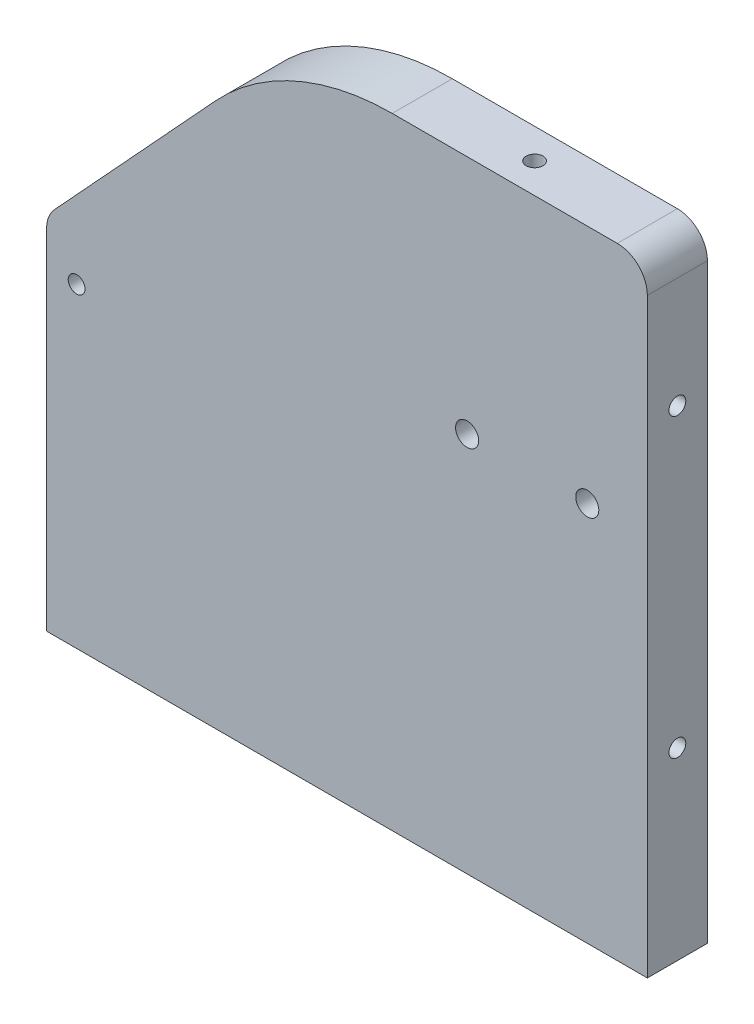
ISO-10303-21;
HEADER;
FILE_DESCRIPTION(('STEP AP214'),'2;1');
FILE_NAME('part.step','',(''),(''),'','','');
FILE_SCHEMA(('AUTOMOTIVE_DESIGN { 1 0 10303 214 1 1 1 1 }'));
ENDSEC;
DATA;
#1=APPLICATION_CONTEXT('core data for automotive mechanical design processes');
#2=APPLICATION_PROTOCOL_DEFINITION('international standard','automotive_design',2000,#1);
#3=PRODUCT_CONTEXT('',#1,'mechanical');
#4=PRODUCT('Part','Part','',(#3));
#5=PRODUCT_RELATED_PRODUCT_CATEGORY('part','',(#4));
#6=PRODUCT_DEFINITION_FORMATION('','',#4);
#7=PRODUCT_DEFINITION_CONTEXT('part definition',#1,'design');
#8=PRODUCT_DEFINITION('design','',#6,#7);
#9=PRODUCT_DEFINITION_SHAPE('','',#8);
#10=(LENGTH_UNIT() NAMED_UNIT(*) SI_UNIT(.MILLI.,.METRE.));
#11=(NAMED_UNIT(*) PLANE_ANGLE_UNIT() SI_UNIT($,.RADIAN.));
#12=(NAMED_UNIT(*) SI_UNIT($,.STERADIAN.) SOLID_ANGLE_UNIT());
#13=UNCERTAINTY_MEASURE_WITH_UNIT(LENGTH_MEASURE(1.E-05),#10,'distance_accuracy_value','');
#14=(GEOMETRIC_REPRESENTATION_CONTEXT(3) GLOBAL_UNCERTAINTY_ASSIGNED_CONTEXT((#13)) GLOBAL_UNIT_ASSIGNED_CONTEXT((#10,
#11,#12)) REPRESENTATION_CONTEXT('',''));
#15=CARTESIAN_POINT('',(0.,0.,0.));
#16=DIRECTION('',(0.,0.,1.));
#17=DIRECTION('',(1.,0.,0.));
#18=AXIS2_PLACEMENT_3D('',#15,#16,#17);
#19=CARTESIAN_POINT('',(25.4,65.659,3.175));
#20=DIRECTION('',(0.735322884140095,-0.677716943907921,0.));
#21=DIRECTION('',(0.677716943907921,0.735322884140095,0.));
#22=AXIS2_PLACEMENT_3D('',#19,#20,#21);
#23=PLANE('',#22);
#24=CARTESIAN_POINT('',(9.36128497860955,48.2569942017914,0.));
#25=DIRECTION('',(-0.735322884140095,0.677716943907922,0.));
#26=DIRECTION('',(-0.677716943907922,-0.735322884140095,0.));
#27=AXIS2_PLACEMENT_3D('',#24,#25,#26);
#28=CIRCLE('',#27,0.888999999999989);
#29=CARTESIAN_POINT('',(8.75879461547542,47.6032921577908,0.));
#30=VERTEX_POINT('',#29);
#31=EDGE_CURVE('E167',#30,#30,#28,.T.);
#32=ORIENTED_EDGE('',*,*,#31,.F.);
#33=EDGE_LOOP('',(#32));
#34=FACE_BOUND('',#33,.T.);
#35=DIRECTION('',(-0.677716943907921,-0.735322884140095,0.));
#36=VECTOR('',#35,1.);
#37=CARTESIAN_POINT('',(25.4,65.659,-3.175));
#38=LINE('',#37,#36);
#39=CARTESIAN_POINT('',(17.8553091016232,57.4730103752612,-3.175));
#40=VERTEX_POINT('',#39);
#41=CARTESIAN_POINT('',(0.84034984285521,39.0117795794979,-3.175));
#42=VERTEX_POINT('',#41);
#43=EDGE_CURVE('E261',#40,#42,#38,.T.);
#44=ORIENTED_EDGE('',*,*,#43,.T.);
#45=DIRECTION('',(0.,0.,-1.));
#46=VECTOR('',#45,1.);
#47=CARTESIAN_POINT('',(0.84034984285521,39.0117795794979,3.175));
#48=LINE('',#47,#46);
#49=CARTESIAN_POINT('',(0.84034984285521,39.0117795794979,3.175));
#50=VERTEX_POINT('',#49);
#51=EDGE_CURVE('E307',#42,#50,#48,.F.);
#52=ORIENTED_EDGE('',*,*,#51,.T.);
#53=DIRECTION('',(-0.677716943907921,-0.735322884140095,0.));
#54=VECTOR('',#53,1.);
#55=CARTESIAN_POINT('',(25.4,65.659,3.175));
#56=LINE('',#55,#54);
#57=CARTESIAN_POINT('',(17.8553091016232,57.4730103752612,3.175));
#58=VERTEX_POINT('',#57);
#59=EDGE_CURVE('E262',#58,#50,#56,.T.);
#60=ORIENTED_EDGE('',*,*,#59,.F.);
#61=DIRECTION('',(0.,0.,-1.));
#62=VECTOR('',#61,1.);
#63=CARTESIAN_POINT('',(17.8553091016232,57.4730103752612,3.175));
#64=LINE('',#63,#62);
#65=EDGE_CURVE('E291',#58,#40,#64,.T.);
#66=ORIENTED_EDGE('',*,*,#65,.T.);
#67=EDGE_LOOP('',(#44,#52,#60,#66));
#68=FACE_BOUND('',#67,.T.);
#69=ADVANCED_FACE('F33',(#34,#68),#23,.F.);
#70=CARTESIAN_POINT('',(0.,38.1,3.175));
#71=DIRECTION('',(1.,0.,0.));
#72=DIRECTION('',(0.,0.,-1.));
#73=AXIS2_PLACEMENT_3D('',#70,#71,#72);
#74=PLANE('',#73);
#75=DIRECTION('',(0.,-1.,0.));
#76=VECTOR('',#75,1.);
#77=CARTESIAN_POINT('',(0.,38.1,3.175));
#78=LINE('',#77,#76);
#79=CARTESIAN_POINT('',(0.,36.8600282825903,3.175));
#80=VERTEX_POINT('',#79);
#81=CARTESIAN_POINT('',(0.,0.,3.175));
#82=VERTEX_POINT('',#81);
#83=EDGE_CURVE('E265',#80,#82,#78,.T.);
#84=ORIENTED_EDGE('',*,*,#83,.F.);
#85=DIRECTION('',(0.,0.,-1.));
#86=VECTOR('',#85,1.);
#87=CARTESIAN_POINT('',(0.,36.8600282825903,3.175));
#88=LINE('',#87,#86);
#89=CARTESIAN_POINT('',(0.,36.8600282825903,-3.175));
#90=VERTEX_POINT('',#89);
#91=EDGE_CURVE('E302',#80,#90,#88,.T.);
#92=ORIENTED_EDGE('',*,*,#91,.T.);
#93=DIRECTION('',(0.,-1.,0.));
#94=VECTOR('',#93,1.);
#95=CARTESIAN_POINT('',(0.,38.1,-3.175));
#96=LINE('',#95,#94);
#97=CARTESIAN_POINT('',(0.,0.,-3.175));
#98=VERTEX_POINT('',#97);
#99=EDGE_CURVE('E278',#90,#98,#96,.T.);
#100=ORIENTED_EDGE('',*,*,#99,.T.);
#101=DIRECTION('',(0.,0.,-1.));
#102=VECTOR('',#101,1.);
#103=CARTESIAN_POINT('',(0.,0.,3.175));
#104=LINE('',#103,#102);
#105=EDGE_CURVE('E288',#82,#98,#104,.T.);
#106=ORIENTED_EDGE('',*,*,#105,.F.);
#107=EDGE_LOOP('',(#84,#92,#100,#106));
#108=FACE_BOUND('',#107,.T.);
#109=ADVANCED_FACE('F338',(#108),#74,.F.);
#110=CARTESIAN_POINT('',(0.,0.,3.175));
#111=DIRECTION('',(0.,1.,0.));
#112=DIRECTION('',(0.,0.,1.));
#113=AXIS2_PLACEMENT_3D('',#110,#111,#112);
#114=PLANE('',#113);
#115=DIRECTION('',(1.,0.,0.));
#116=VECTOR('',#115,1.);
#117=CARTESIAN_POINT('',(0.,0.,-3.175));
#118=LINE('',#117,#116);
#119=CARTESIAN_POINT('',(63.5,0.,-3.175));
#120=VERTEX_POINT('',#119);
#121=EDGE_CURVE('E280',#98,#120,#118,.T.);
#122=ORIENTED_EDGE('',*,*,#121,.T.);
#123=DIRECTION('',(0.,0.,-1.));
#124=VECTOR('',#123,1.);
#125=CARTESIAN_POINT('',(63.5,0.,3.175));
#126=LINE('',#125,#124);
#127=CARTESIAN_POINT('',(63.5,0.,3.175));
#128=VERTEX_POINT('',#127);
#129=EDGE_CURVE('E275',#128,#120,#126,.T.);
#130=ORIENTED_EDGE('',*,*,#129,.F.);
#131=DIRECTION('',(1.,0.,0.));
#132=VECTOR('',#131,1.);
#133=CARTESIAN_POINT('',(0.,0.,3.175));
#134=LINE('',#133,#132);
#135=EDGE_CURVE('E268',#82,#128,#134,.T.);
#136=ORIENTED_EDGE('',*,*,#135,.F.);
#137=ORIENTED_EDGE('',*,*,#105,.T.);
#138=EDGE_LOOP('',(#122,#130,#136,#137));
#139=FACE_BOUND('',#138,.T.);
#140=ADVANCED_FACE('F346',(#139),#114,.F.);
#141=CARTESIAN_POINT('',(63.5,0.,3.175));
#142=DIRECTION('',(-1.,0.,0.));
#143=DIRECTION('',(0.,0.,1.));
#144=AXIS2_PLACEMENT_3D('',#141,#142,#143);
#145=PLANE('',#144);
#146=CARTESIAN_POINT('',(63.5,50.7960590088388,0.));
#147=DIRECTION('',(1.,0.,0.));
#148=DIRECTION('',(0.,0.,-1.));
#149=AXIS2_PLACEMENT_3D('',#146,#147,#148);
#150=CIRCLE('',#149,0.888999999999994);
#151=CARTESIAN_POINT('',(63.5,50.7960590088388,-0.889000000000022));
#152=VERTEX_POINT('',#151);
#153=EDGE_CURVE('E249',#152,#152,#150,.T.);
#154=ORIENTED_EDGE('',*,*,#153,.F.);
#155=EDGE_LOOP('',(#154));
#156=FACE_BOUND('',#155,.T.);
#157=CARTESIAN_POINT('',(63.5,19.4769737992395,0.));
#158=DIRECTION('',(1.,0.,0.));
#159=DIRECTION('',(0.,0.,-1.));
#160=AXIS2_PLACEMENT_3D('',#157,#158,#159);
#161=CIRCLE('',#160,0.888999999999997);
#162=CARTESIAN_POINT('',(63.5,19.4769737992395,-0.889000000000025));
#163=VERTEX_POINT('',#162);
#164=EDGE_CURVE('E255',#163,#163,#161,.T.);
#165=ORIENTED_EDGE('',*,*,#164,.F.);
#166=EDGE_LOOP('',(#165));
#167=FACE_BOUND('',#166,.T.);
#168=DIRECTION('',(0.,1.,0.));
#169=VECTOR('',#168,1.);
#170=CARTESIAN_POINT('',(63.5,0.,-3.175));
#171=LINE('',#170,#169);
#172=CARTESIAN_POINT('',(63.5,62.484,-3.175));
#173=VERTEX_POINT('',#172);
#174=EDGE_CURVE('E282',#120,#173,#171,.T.);
#175=ORIENTED_EDGE('',*,*,#174,.T.);
#176=DIRECTION('',(0.,0.,-1.));
#177=VECTOR('',#176,1.);
#178=CARTESIAN_POINT('',(63.5,62.484,3.175));
#179=LINE('',#178,#177);
#180=CARTESIAN_POINT('',(63.5,62.484,3.175));
#181=VERTEX_POINT('',#180);
#182=EDGE_CURVE('E42',#173,#181,#179,.F.);
#183=ORIENTED_EDGE('',*,*,#182,.T.);
#184=DIRECTION('',(0.,1.,0.));
#185=VECTOR('',#184,1.);
#186=CARTESIAN_POINT('',(63.5,0.,3.175));
#187=LINE('',#186,#185);
#188=EDGE_CURVE('E270',#128,#181,#187,.T.);
#189=ORIENTED_EDGE('',*,*,#188,.F.);
#190=ORIENTED_EDGE('',*,*,#129,.T.);
#191=EDGE_LOOP('',(#175,#183,#189,#190));
#192=FACE_BOUND('',#191,.T.);
#193=ADVANCED_FACE('F392',(#156,#167,#192),#145,.F.);
#194=CARTESIAN_POINT('',(63.5,65.659,3.175));
#195=DIRECTION('',(0.,-1.,0.));
#196=DIRECTION('',(1.,0.,0.));
#197=AXIS2_PLACEMENT_3D('',#194,#195,#196);
#198=PLANE('',#197);
#199=CARTESIAN_POINT('',(48.4070103587819,65.659,0.));
#200=DIRECTION('',(0.,1.,0.));
#201=DIRECTION('',(0.,0.,1.));
#202=AXIS2_PLACEMENT_3D('',#199,#200,#201);
#203=CIRCLE('',#202,0.888999999999987);
#204=CARTESIAN_POINT('',(48.4070103587819,65.659,0.888999999999973));
#205=VERTEX_POINT('',#204);
#206=EDGE_CURVE('E168',#205,#205,#203,.T.);
#207=ORIENTED_EDGE('',*,*,#206,.F.);
#208=EDGE_LOOP('',(#207));
#209=FACE_BOUND('',#208,.T.);
#210=DIRECTION('',(-1.,0.,0.));
#211=VECTOR('',#210,1.);
#212=CARTESIAN_POINT('',(63.5,65.659,3.175));
#213=LINE('',#212,#211);
#214=CARTESIAN_POINT('',(60.325,65.659,3.175));
#215=VERTEX_POINT('',#214);
#216=CARTESIAN_POINT('',(36.5325103587816,65.659,3.175));
#217=VERTEX_POINT('',#216);
#218=EDGE_CURVE('E273',#215,#217,#213,.T.);
#219=ORIENTED_EDGE('',*,*,#218,.F.);
#220=DIRECTION('',(0.,0.,-1.));
#221=VECTOR('',#220,1.);
#222=CARTESIAN_POINT('',(60.325,65.659,3.175));
#223=LINE('',#222,#221);
#224=CARTESIAN_POINT('',(60.325,65.659,-3.175));
#225=VERTEX_POINT('',#224);
#226=EDGE_CURVE('E311',#215,#225,#223,.T.);
#227=ORIENTED_EDGE('',*,*,#226,.T.);
#228=DIRECTION('',(-1.,0.,0.));
#229=VECTOR('',#228,1.);
#230=CARTESIAN_POINT('',(63.5,65.659,-3.175));
#231=LINE('',#230,#229);
#232=CARTESIAN_POINT('',(36.5325103587816,65.659,-3.175));
#233=VERTEX_POINT('',#232);
#234=EDGE_CURVE('E266',#225,#233,#231,.T.);
#235=ORIENTED_EDGE('',*,*,#234,.T.);
#236=DIRECTION('',(0.,0.,-1.));
#237=VECTOR('',#236,1.);
#238=CARTESIAN_POINT('',(36.5325103587816,65.659,3.175));
#239=LINE('',#238,#237);
#240=EDGE_CURVE('E297',#233,#217,#239,.F.);
#241=ORIENTED_EDGE('',*,*,#240,.T.);
#242=EDGE_LOOP('',(#219,#227,#235,#241));
#243=FACE_BOUND('',#242,.T.);
#244=ADVANCED_FACE('F385',(#209,#243),#198,.F.);
#245=CARTESIAN_POINT('',(-35.1152073732719,0.,3.175));
#246=DIRECTION('',(0.,0.,1.));
#247=DIRECTION('',(1.,0.,0.));
#248=AXIS2_PLACEMENT_3D('',#245,#246,#247);
#249=PLANE('',#248);
#250=CARTESIAN_POINT('',(3.175,33.3375,3.175));
#251=DIRECTION('',(0.,0.,1.));
#252=DIRECTION('',(1.,0.,0.));
#253=AXIS2_PLACEMENT_3D('',#250,#251,#252);
#254=CIRCLE('',#253,0.888999999999989);
#255=CARTESIAN_POINT('',(4.06399999999999,33.3375,3.175));
#256=VERTEX_POINT('',#255);
#257=EDGE_CURVE('E663',#256,#256,#254,.T.);
#258=ORIENTED_EDGE('',*,*,#257,.F.);
#259=EDGE_LOOP('',(#258));
#260=FACE_BOUND('',#259,.T.);
#261=CARTESIAN_POINT('',(57.15,40.259,3.175));
#262=DIRECTION('',(0.,0.,1.));
#263=DIRECTION('',(1.,0.,0.));
#264=AXIS2_PLACEMENT_3D('',#261,#262,#263);
#265=CIRCLE('',#264,1.21919999999999);
#266=CARTESIAN_POINT('',(58.3692,40.259,3.175));
#267=VERTEX_POINT('',#266);
#268=EDGE_CURVE('E234',#267,#267,#265,.T.);
#269=ORIENTED_EDGE('',*,*,#268,.F.);
#270=EDGE_LOOP('',(#269));
#271=FACE_BOUND('',#270,.T.);
#272=CARTESIAN_POINT('',(44.45,40.259,3.175));
#273=DIRECTION('',(0.,0.,1.));
#274=DIRECTION('',(1.,0.,0.));
#275=AXIS2_PLACEMENT_3D('',#272,#273,#274);
#276=CIRCLE('',#275,1.21919999999999);
#277=CARTESIAN_POINT('',(45.6692,40.259,3.175));
#278=VERTEX_POINT('',#277);
#279=EDGE_CURVE('E243',#278,#278,#276,.T.);
#280=ORIENTED_EDGE('',*,*,#279,.F.);
#281=EDGE_LOOP('',(#280));
#282=FACE_BOUND('',#281,.T.);
#283=ORIENTED_EDGE('',*,*,#188,.T.);
#284=CARTESIAN_POINT('',(60.325,62.484,3.175));
#285=DIRECTION('',(0.,0.,1.));
#286=DIRECTION('',(1.,0.,0.));
#287=AXIS2_PLACEMENT_3D('',#284,#285,#286);
#288=CIRCLE('',#287,3.175);
#289=EDGE_CURVE('E11',#181,#215,#288,.T.);
#290=ORIENTED_EDGE('',*,*,#289,.T.);
#291=ORIENTED_EDGE('',*,*,#218,.T.);
#292=CARTESIAN_POINT('',(36.5325103587816,40.259,3.175));
#293=DIRECTION('',(0.,0.,1.));
#294=DIRECTION('',(1.,0.,0.));
#295=AXIS2_PLACEMENT_3D('',#292,#293,#294);
#296=CIRCLE('',#295,25.4);
#297=EDGE_CURVE('E300',#217,#58,#296,.T.);
#298=ORIENTED_EDGE('',*,*,#297,.T.);
#299=ORIENTED_EDGE('',*,*,#59,.T.);
#300=CARTESIAN_POINT('',(3.175,36.8600282825903,3.175));
#301=DIRECTION('',(0.,0.,1.));
#302=DIRECTION('',(1.,0.,0.));
#303=AXIS2_PLACEMENT_3D('',#300,#301,#302);
#304=CIRCLE('',#303,3.175);
#305=EDGE_CURVE('E309',#50,#80,#304,.T.);
#306=ORIENTED_EDGE('',*,*,#305,.T.);
#307=ORIENTED_EDGE('',*,*,#83,.T.);
#308=ORIENTED_EDGE('',*,*,#135,.T.);
#309=EDGE_LOOP('',(#283,#290,#291,#298,#299,#306,#307,#308));
#310=FACE_BOUND('',#309,.T.);
#311=ADVANCED_FACE('F369',(#260,#271,#282,#310),#249,.T.);
#312=CARTESIAN_POINT('',(-35.1152073732719,0.,-3.175));
#313=DIRECTION('',(0.,0.,1.));
#314=DIRECTION('',(1.,0.,0.));
#315=AXIS2_PLACEMENT_3D('',#312,#313,#314);
#316=PLANE('',#315);
#317=CARTESIAN_POINT('',(3.175,33.3375,-3.175));
#318=DIRECTION('',(0.,0.,1.));
#319=DIRECTION('',(1.,0.,0.));
#320=AXIS2_PLACEMENT_3D('',#317,#318,#319);
#321=CIRCLE('',#320,0.888999999999988);
#322=CARTESIAN_POINT('',(4.06399999999999,33.3375,-3.175));
#323=VERTEX_POINT('',#322);
#324=EDGE_CURVE('E37',#323,#323,#321,.T.);
#325=ORIENTED_EDGE('',*,*,#324,.T.);
#326=EDGE_LOOP('',(#325));
#327=FACE_BOUND('',#326,.T.);
#328=DIRECTION('',(-1.,0.,0.));
#329=VECTOR('',#328,1.);
#330=CARTESIAN_POINT('',(1.58750000000001,9.525,-3.175));
#331=LINE('',#330,#329);
#332=CARTESIAN_POINT('',(3.17500000000001,9.525,-3.175));
#333=VERTEX_POINT('',#332);
#334=CARTESIAN_POINT('',(1.58750000000001,9.525,-3.175));
#335=VERTEX_POINT('',#334);
#336=EDGE_CURVE('E194',#333,#335,#331,.T.);
#337=ORIENTED_EDGE('',*,*,#336,.F.);
#338=DIRECTION('',(0.,-1.,0.));
#339=VECTOR('',#338,1.);
#340=CARTESIAN_POINT('',(3.17500000000001,12.7,-3.175));
#341=LINE('',#340,#339);
#342=CARTESIAN_POINT('',(3.17500000000001,12.7,-3.175));
#343=VERTEX_POINT('',#342);
#344=EDGE_CURVE('E50',#343,#333,#341,.T.);
#345=ORIENTED_EDGE('',*,*,#344,.F.);
#346=DIRECTION('',(1.,0.,0.));
#347=VECTOR('',#346,1.);
#348=CARTESIAN_POINT('',(1.58750000000001,12.7,-3.175));
#349=LINE('',#348,#347);
#350=CARTESIAN_POINT('',(1.58750000000001,12.7,-3.175));
#351=VERTEX_POINT('',#350);
#352=EDGE_CURVE('E183',#351,#343,#349,.T.);
#353=ORIENTED_EDGE('',*,*,#352,.F.);
#354=DIRECTION('',(0.,1.,0.));
#355=VECTOR('',#354,1.);
#356=CARTESIAN_POINT('',(1.58750000000001,12.7,-3.175));
#357=LINE('',#356,#355);
#358=EDGE_CURVE('E197',#335,#351,#357,.T.);
#359=ORIENTED_EDGE('',*,*,#358,.F.);
#360=EDGE_LOOP('',(#337,#345,#353,#359));
#361=FACE_BOUND('',#360,.T.);
#362=DIRECTION('',(-1.,0.,0.));
#363=VECTOR('',#362,1.);
#364=CARTESIAN_POINT('',(1.58750000000001,22.225,-3.175));
#365=LINE('',#364,#363);
#366=CARTESIAN_POINT('',(3.175,22.225,-3.175));
#367=VERTEX_POINT('',#366);
#368=CARTESIAN_POINT('',(1.58750000000001,22.225,-3.175));
#369=VERTEX_POINT('',#368);
#370=EDGE_CURVE('E224',#367,#369,#365,.T.);
#371=ORIENTED_EDGE('',*,*,#370,.F.);
#372=DIRECTION('',(0.,-1.,0.));
#373=VECTOR('',#372,1.);
#374=CARTESIAN_POINT('',(3.17500000000001,25.4,-3.175));
#375=LINE('',#374,#373);
#376=CARTESIAN_POINT('',(3.17500000000001,25.4,-3.175));
#377=VERTEX_POINT('',#376);
#378=EDGE_CURVE('E58',#377,#367,#375,.T.);
#379=ORIENTED_EDGE('',*,*,#378,.F.);
#380=DIRECTION('',(1.,0.,0.));
#381=VECTOR('',#380,1.);
#382=CARTESIAN_POINT('',(1.58750000000001,25.4,-3.175));
#383=LINE('',#382,#381);
#384=CARTESIAN_POINT('',(1.58750000000001,25.4,-3.175));
#385=VERTEX_POINT('',#384);
#386=EDGE_CURVE('E213',#385,#377,#383,.T.);
#387=ORIENTED_EDGE('',*,*,#386,.F.);
#388=DIRECTION('',(0.,1.,0.));
#389=VECTOR('',#388,1.);
#390=CARTESIAN_POINT('',(1.58750000000001,25.4,-3.175));
#391=LINE('',#390,#389);
#392=EDGE_CURVE('E227',#369,#385,#391,.T.);
#393=ORIENTED_EDGE('',*,*,#392,.F.);
#394=EDGE_LOOP('',(#371,#379,#387,#393));
#395=FACE_BOUND('',#394,.T.);
#396=CARTESIAN_POINT('',(57.15,40.259,-3.175));
#397=DIRECTION('',(0.,0.,1.));
#398=DIRECTION('',(1.,0.,0.));
#399=AXIS2_PLACEMENT_3D('',#396,#397,#398);
#400=CIRCLE('',#399,1.21919999999999);
#401=CARTESIAN_POINT('',(58.3692,40.259,-3.175));
#402=VERTEX_POINT('',#401);
#403=EDGE_CURVE('E242',#402,#402,#400,.T.);
#404=ORIENTED_EDGE('',*,*,#403,.T.);
#405=EDGE_LOOP('',(#404));
#406=FACE_BOUND('',#405,.T.);
#407=CARTESIAN_POINT('',(44.45,40.259,-3.175));
#408=DIRECTION('',(0.,0.,1.));
#409=DIRECTION('',(1.,0.,0.));
#410=AXIS2_PLACEMENT_3D('',#407,#408,#409);
#411=CIRCLE('',#410,1.21919999999999);
#412=CARTESIAN_POINT('',(45.6692,40.259,-3.175));
#413=VERTEX_POINT('',#412);
#414=EDGE_CURVE('E246',#413,#413,#411,.T.);
#415=ORIENTED_EDGE('',*,*,#414,.T.);
#416=EDGE_LOOP('',(#415));
#417=FACE_BOUND('',#416,.T.);
#418=ORIENTED_EDGE('',*,*,#234,.F.);
#419=CARTESIAN_POINT('',(60.325,62.484,-3.175));
#420=DIRECTION('',(0.,0.,1.));
#421=DIRECTION('',(1.,0.,0.));
#422=AXIS2_PLACEMENT_3D('',#419,#420,#421);
#423=CIRCLE('',#422,3.175);
#424=EDGE_CURVE('E314',#225,#173,#423,.F.);
#425=ORIENTED_EDGE('',*,*,#424,.T.);
#426=ORIENTED_EDGE('',*,*,#174,.F.);
#427=ORIENTED_EDGE('',*,*,#121,.F.);
#428=ORIENTED_EDGE('',*,*,#99,.F.);
#429=CARTESIAN_POINT('',(3.175,36.8600282825903,-3.175));
#430=DIRECTION('',(0.,0.,1.));
#431=DIRECTION('',(1.,0.,0.));
#432=AXIS2_PLACEMENT_3D('',#429,#430,#431);
#433=CIRCLE('',#432,3.175);
#434=EDGE_CURVE('E305',#90,#42,#433,.F.);
#435=ORIENTED_EDGE('',*,*,#434,.T.);
#436=ORIENTED_EDGE('',*,*,#43,.F.);
#437=CARTESIAN_POINT('',(36.5325103587816,40.259,-3.175));
#438=DIRECTION('',(0.,0.,1.));
#439=DIRECTION('',(1.,0.,0.));
#440=AXIS2_PLACEMENT_3D('',#437,#438,#439);
#441=CIRCLE('',#440,25.4);
#442=EDGE_CURVE('E294',#40,#233,#441,.F.);
#443=ORIENTED_EDGE('',*,*,#442,.T.);
#444=EDGE_LOOP('',(#418,#425,#426,#427,#428,#435,#436,#443));
#445=FACE_BOUND('',#444,.T.);
#446=ADVANCED_FACE('F319',(#327,#361,#395,#406,#417,#445),#316,.F.);
#447=CARTESIAN_POINT('',(36.5325103587816,40.259,3.175));
#448=DIRECTION('',(0.,0.,-1.));
#449=DIRECTION('',(-1.,0.,0.));
#450=AXIS2_PLACEMENT_3D('',#447,#448,#449);
#451=CYLINDRICAL_SURFACE('',#450,25.4);
#452=ORIENTED_EDGE('',*,*,#297,.F.);
#453=ORIENTED_EDGE('',*,*,#240,.F.);
#454=ORIENTED_EDGE('',*,*,#442,.F.);
#455=ORIENTED_EDGE('',*,*,#65,.F.);
#456=EDGE_LOOP('',(#452,#453,#454,#455));
#457=FACE_BOUND('',#456,.T.);
#458=ADVANCED_FACE('F353',(#457),#451,.T.);
#459=CARTESIAN_POINT('',(3.175,36.8600282825903,3.175));
#460=DIRECTION('',(0.,0.,-1.));
#461=DIRECTION('',(-1.,0.,0.));
#462=AXIS2_PLACEMENT_3D('',#459,#460,#461);
#463=CYLINDRICAL_SURFACE('',#462,3.175);
#464=ORIENTED_EDGE('',*,*,#305,.F.);
#465=ORIENTED_EDGE('',*,*,#51,.F.);
#466=ORIENTED_EDGE('',*,*,#434,.F.);
#467=ORIENTED_EDGE('',*,*,#91,.F.);
#468=EDGE_LOOP('',(#464,#465,#466,#467));
#469=FACE_BOUND('',#468,.T.);
#470=ADVANCED_FACE('F355',(#469),#463,.T.);
#471=CARTESIAN_POINT('',(60.325,62.484,3.175));
#472=DIRECTION('',(0.,0.,-1.));
#473=DIRECTION('',(-1.,0.,0.));
#474=AXIS2_PLACEMENT_3D('',#471,#472,#473);
#475=CYLINDRICAL_SURFACE('',#474,3.175);
#476=ORIENTED_EDGE('',*,*,#289,.F.);
#477=ORIENTED_EDGE('',*,*,#182,.F.);
#478=ORIENTED_EDGE('',*,*,#424,.F.);
#479=ORIENTED_EDGE('',*,*,#226,.F.);
#480=EDGE_LOOP('',(#476,#477,#478,#479));
#481=FACE_BOUND('',#480,.T.);
#482=ADVANCED_FACE('F35',(#481),#475,.T.);
#483=CARTESIAN_POINT('',(57.912,19.4769737992395,0.));
#484=DIRECTION('',(1.,0.,0.));
#485=DIRECTION('',(0.,0.,-1.));
#486=AXIS2_PLACEMENT_3D('',#483,#484,#485);
#487=CONICAL_SURFACE('',#486,0.888999999999997,1.02974425867665);
#488=CARTESIAN_POINT('',(57.3778349096845,19.4769737992395,0.));
#489=VERTEX_POINT('',#488);
#490=VERTEX_LOOP('',#489);
#491=FACE_BOUND('',#490,.T.);
#492=CARTESIAN_POINT('',(57.912,19.4769737992395,0.));
#493=DIRECTION('',(1.,0.,0.));
#494=DIRECTION('',(0.,0.,-1.));
#495=AXIS2_PLACEMENT_3D('',#492,#493,#494);
#496=CIRCLE('',#495,0.888999999999997);
#497=CARTESIAN_POINT('',(57.912,19.4769737992395,-0.889000000000025));
#498=VERTEX_POINT('',#497);
#499=EDGE_CURVE('E258',#498,#498,#496,.T.);
#500=ORIENTED_EDGE('',*,*,#499,.T.);
#501=EDGE_LOOP('',(#500));
#502=FACE_BOUND('',#501,.T.);
#503=ADVANCED_FACE('F362',(#491,#502),#487,.F.);
#504=CARTESIAN_POINT('',(63.5,19.4769737992395,0.));
#505=DIRECTION('',(1.,0.,0.));
#506=DIRECTION('',(0.,0.,-1.));
#507=AXIS2_PLACEMENT_3D('',#504,#505,#506);
#508=CYLINDRICAL_SURFACE('',#507,0.888999999999997);
#509=ORIENTED_EDGE('',*,*,#499,.F.);
#510=EDGE_LOOP('',(#509));
#511=FACE_BOUND('',#510,.T.);
#512=ORIENTED_EDGE('',*,*,#164,.T.);
#513=EDGE_LOOP('',(#512));
#514=FACE_BOUND('',#513,.T.);
#515=ADVANCED_FACE('F415',(#511,#514),#508,.F.);
#516=CARTESIAN_POINT('',(57.912,50.7960590088388,0.));
#517=DIRECTION('',(1.,0.,0.));
#518=DIRECTION('',(0.,0.,-1.));
#519=AXIS2_PLACEMENT_3D('',#516,#517,#518);
#520=CONICAL_SURFACE('',#519,0.888999999999994,1.02974425867665);
#521=CARTESIAN_POINT('',(57.3778349096845,50.7960590088388,0.));
#522=VERTEX_POINT('',#521);
#523=VERTEX_LOOP('',#522);
#524=FACE_BOUND('',#523,.T.);
#525=CARTESIAN_POINT('',(57.912,50.7960590088388,0.));
#526=DIRECTION('',(1.,0.,0.));
#527=DIRECTION('',(0.,0.,-1.));
#528=AXIS2_PLACEMENT_3D('',#525,#526,#527);
#529=CIRCLE('',#528,0.888999999999994);
#530=CARTESIAN_POINT('',(57.912,50.7960590088388,-0.889000000000022));
#531=VERTEX_POINT('',#530);
#532=EDGE_CURVE('E252',#531,#531,#529,.T.);
#533=ORIENTED_EDGE('',*,*,#532,.T.);
#534=EDGE_LOOP('',(#533));
#535=FACE_BOUND('',#534,.T.);
#536=ADVANCED_FACE('F419',(#524,#535),#520,.F.);
#537=CARTESIAN_POINT('',(63.5,50.7960590088388,0.));
#538=DIRECTION('',(1.,0.,0.));
#539=DIRECTION('',(0.,0.,-1.));
#540=AXIS2_PLACEMENT_3D('',#537,#538,#539);
#541=CYLINDRICAL_SURFACE('',#540,0.888999999999994);
#542=ORIENTED_EDGE('',*,*,#532,.F.);
#543=EDGE_LOOP('',(#542));
#544=FACE_BOUND('',#543,.T.);
#545=ORIENTED_EDGE('',*,*,#153,.T.);
#546=EDGE_LOOP('',(#545));
#547=FACE_BOUND('',#546,.T.);
#548=ADVANCED_FACE('F334',(#544,#547),#541,.F.);
#549=CARTESIAN_POINT('',(44.45,40.259,3.175));
#550=DIRECTION('',(0.,0.,1.));
#551=DIRECTION('',(1.,0.,0.));
#552=AXIS2_PLACEMENT_3D('',#549,#550,#551);
#553=CYLINDRICAL_SURFACE('',#552,1.21919999999999);
#554=ORIENTED_EDGE('',*,*,#279,.T.);
#555=EDGE_LOOP('',(#554));
#556=FACE_BOUND('',#555,.T.);
#557=ORIENTED_EDGE('',*,*,#414,.F.);
#558=EDGE_LOOP('',(#557));
#559=FACE_BOUND('',#558,.T.);
#560=ADVANCED_FACE('F325',(#556,#559),#553,.F.);
#561=CARTESIAN_POINT('',(57.15,40.259,3.175));
#562=DIRECTION('',(0.,0.,1.));
#563=DIRECTION('',(1.,0.,0.));
#564=AXIS2_PLACEMENT_3D('',#561,#562,#563);
#565=CYLINDRICAL_SURFACE('',#564,1.21919999999999);
#566=ORIENTED_EDGE('',*,*,#268,.T.);
#567=EDGE_LOOP('',(#566));
#568=FACE_BOUND('',#567,.T.);
#569=ORIENTED_EDGE('',*,*,#403,.F.);
#570=EDGE_LOOP('',(#569));
#571=FACE_BOUND('',#570,.T.);
#572=ADVANCED_FACE('F322',(#568,#571),#565,.F.);
#573=CARTESIAN_POINT('',(3.17500000000001,25.4,0.));
#574=DIRECTION('',(1.,0.,0.));
#575=DIRECTION('',(0.,1.,0.));
#576=AXIS2_PLACEMENT_3D('',#573,#574,#575);
#577=PLANE('',#576);
#578=ORIENTED_EDGE('',*,*,#378,.T.);
#579=DIRECTION('',(0.,0.,-1.));
#580=VECTOR('',#579,1.);
#581=CARTESIAN_POINT('',(3.17500000000001,22.225,0.));
#582=LINE('',#581,#580);
#583=CARTESIAN_POINT('',(3.17500000000001,22.225,0.));
#584=VERTEX_POINT('',#583);
#585=EDGE_CURVE('E222',#584,#367,#582,.T.);
#586=ORIENTED_EDGE('',*,*,#585,.F.);
#587=DIRECTION('',(0.,-1.,0.));
#588=VECTOR('',#587,1.);
#589=CARTESIAN_POINT('',(3.17500000000001,25.4,0.));
#590=LINE('',#589,#588);
#591=CARTESIAN_POINT('',(3.17500000000001,25.4,0.));
#592=VERTEX_POINT('',#591);
#593=EDGE_CURVE('E209',#592,#584,#590,.T.);
#594=ORIENTED_EDGE('',*,*,#593,.F.);
#595=DIRECTION('',(0.,0.,-1.));
#596=VECTOR('',#595,1.);
#597=CARTESIAN_POINT('',(3.17500000000001,25.4,0.));
#598=LINE('',#597,#596);
#599=EDGE_CURVE('E232',#592,#377,#598,.T.);
#600=ORIENTED_EDGE('',*,*,#599,.T.);
#601=EDGE_LOOP('',(#578,#586,#594,#600));
#602=FACE_BOUND('',#601,.T.);
#603=ADVANCED_FACE('F324',(#602),#577,.F.);
#604=CARTESIAN_POINT('',(1.58750000000001,25.4,0.));
#605=DIRECTION('',(0.,1.,0.));
#606=DIRECTION('',(0.,0.,1.));
#607=AXIS2_PLACEMENT_3D('',#604,#605,#606);
#608=PLANE('',#607);
#609=ORIENTED_EDGE('',*,*,#386,.T.);
#610=ORIENTED_EDGE('',*,*,#599,.F.);
#611=DIRECTION('',(1.,0.,0.));
#612=VECTOR('',#611,1.);
#613=CARTESIAN_POINT('',(1.58750000000001,25.4,0.));
#614=LINE('',#613,#612);
#615=CARTESIAN_POINT('',(1.58750000000001,25.4,0.));
#616=VERTEX_POINT('',#615);
#617=EDGE_CURVE('E219',#616,#592,#614,.T.);
#618=ORIENTED_EDGE('',*,*,#617,.F.);
#619=DIRECTION('',(0.,0.,-1.));
#620=VECTOR('',#619,1.);
#621=CARTESIAN_POINT('',(1.58750000000001,25.4,0.));
#622=LINE('',#621,#620);
#623=EDGE_CURVE('E235',#616,#385,#622,.T.);
#624=ORIENTED_EDGE('',*,*,#623,.T.);
#625=EDGE_LOOP('',(#609,#610,#618,#624));
#626=FACE_BOUND('',#625,.T.);
#627=ADVANCED_FACE('F332',(#626),#608,.F.);
#628=CARTESIAN_POINT('',(1.58750000000001,25.4,0.));
#629=DIRECTION('',(-1.,0.,0.));
#630=DIRECTION('',(0.,-1.,0.));
#631=AXIS2_PLACEMENT_3D('',#628,#629,#630);
#632=PLANE('',#631);
#633=ORIENTED_EDGE('',*,*,#392,.T.);
#634=ORIENTED_EDGE('',*,*,#623,.F.);
#635=DIRECTION('',(0.,1.,0.));
#636=VECTOR('',#635,1.);
#637=CARTESIAN_POINT('',(1.58750000000001,25.4,0.));
#638=LINE('',#637,#636);
#639=CARTESIAN_POINT('',(1.58750000000001,22.225,0.));
#640=VERTEX_POINT('',#639);
#641=EDGE_CURVE('E216',#640,#616,#638,.T.);
#642=ORIENTED_EDGE('',*,*,#641,.F.);
#643=DIRECTION('',(0.,0.,-1.));
#644=VECTOR('',#643,1.);
#645=CARTESIAN_POINT('',(1.58750000000001,22.225,0.));
#646=LINE('',#645,#644);
#647=EDGE_CURVE('E237',#640,#369,#646,.T.);
#648=ORIENTED_EDGE('',*,*,#647,.T.);
#649=EDGE_LOOP('',(#633,#634,#642,#648));
#650=FACE_BOUND('',#649,.T.);
#651=ADVANCED_FACE('F460',(#650),#632,.F.);
#652=CARTESIAN_POINT('',(1.58750000000001,22.225,0.));
#653=DIRECTION('',(0.,-1.,0.));
#654=DIRECTION('',(0.,0.,-1.));
#655=AXIS2_PLACEMENT_3D('',#652,#653,#654);
#656=PLANE('',#655);
#657=ORIENTED_EDGE('',*,*,#370,.T.);
#658=ORIENTED_EDGE('',*,*,#647,.F.);
#659=DIRECTION('',(-1.,0.,0.));
#660=VECTOR('',#659,1.);
#661=CARTESIAN_POINT('',(1.58750000000001,22.225,0.));
#662=LINE('',#661,#660);
#663=EDGE_CURVE('E212',#584,#640,#662,.T.);
#664=ORIENTED_EDGE('',*,*,#663,.F.);
#665=ORIENTED_EDGE('',*,*,#585,.T.);
#666=EDGE_LOOP('',(#657,#658,#664,#665));
#667=FACE_BOUND('',#666,.T.);
#668=ADVANCED_FACE('F470',(#667),#656,.F.);
#669=CARTESIAN_POINT('',(3.17500000000001,22.225,0.));
#670=DIRECTION('',(0.,0.,1.));
#671=DIRECTION('',(1.,0.,0.));
#672=AXIS2_PLACEMENT_3D('',#669,#670,#671);
#673=PLANE('',#672);
#674=ORIENTED_EDGE('',*,*,#593,.T.);
#675=ORIENTED_EDGE('',*,*,#663,.T.);
#676=ORIENTED_EDGE('',*,*,#641,.T.);
#677=ORIENTED_EDGE('',*,*,#617,.T.);
#678=EDGE_LOOP('',(#674,#675,#676,#677));
#679=FACE_BOUND('',#678,.T.);
#680=ADVANCED_FACE('F480',(#679),#673,.F.);
#681=CARTESIAN_POINT('',(3.17500000000001,12.7,0.));
#682=DIRECTION('',(1.,0.,0.));
#683=DIRECTION('',(0.,1.,0.));
#684=AXIS2_PLACEMENT_3D('',#681,#682,#683);
#685=PLANE('',#684);
#686=ORIENTED_EDGE('',*,*,#344,.T.);
#687=DIRECTION('',(0.,0.,-1.));
#688=VECTOR('',#687,1.);
#689=CARTESIAN_POINT('',(3.17500000000001,9.525,0.));
#690=LINE('',#689,#688);
#691=CARTESIAN_POINT('',(3.17500000000001,9.525,0.));
#692=VERTEX_POINT('',#691);
#693=EDGE_CURVE('E192',#692,#333,#690,.T.);
#694=ORIENTED_EDGE('',*,*,#693,.F.);
#695=DIRECTION('',(0.,-1.,0.));
#696=VECTOR('',#695,1.);
#697=CARTESIAN_POINT('',(3.17500000000001,12.7,0.));
#698=LINE('',#697,#696);
#699=CARTESIAN_POINT('',(3.17500000000001,12.7,0.));
#700=VERTEX_POINT('',#699);
#701=EDGE_CURVE('E179',#700,#692,#698,.T.);
#702=ORIENTED_EDGE('',*,*,#701,.F.);
#703=DIRECTION('',(0.,0.,-1.));
#704=VECTOR('',#703,1.);
#705=CARTESIAN_POINT('',(3.17500000000001,12.7,0.));
#706=LINE('',#705,#704);
#707=EDGE_CURVE('E202',#700,#343,#706,.T.);
#708=ORIENTED_EDGE('',*,*,#707,.T.);
#709=EDGE_LOOP('',(#686,#694,#702,#708));
#710=FACE_BOUND('',#709,.T.);
#711=ADVANCED_FACE('F490',(#710),#685,.F.);
#712=CARTESIAN_POINT('',(1.58750000000001,12.7,0.));
#713=DIRECTION('',(0.,1.,0.));
#714=DIRECTION('',(0.,0.,1.));
#715=AXIS2_PLACEMENT_3D('',#712,#713,#714);
#716=PLANE('',#715);
#717=ORIENTED_EDGE('',*,*,#352,.T.);
#718=ORIENTED_EDGE('',*,*,#707,.F.);
#719=DIRECTION('',(1.,0.,0.));
#720=VECTOR('',#719,1.);
#721=CARTESIAN_POINT('',(1.58750000000001,12.7,0.));
#722=LINE('',#721,#720);
#723=CARTESIAN_POINT('',(1.58750000000001,12.7,0.));
#724=VERTEX_POINT('',#723);
#725=EDGE_CURVE('E189',#724,#700,#722,.T.);
#726=ORIENTED_EDGE('',*,*,#725,.F.);
#727=DIRECTION('',(0.,0.,-1.));
#728=VECTOR('',#727,1.);
#729=CARTESIAN_POINT('',(1.58750000000001,12.7,0.));
#730=LINE('',#729,#728);
#731=EDGE_CURVE('E204',#724,#351,#730,.T.);
#732=ORIENTED_EDGE('',*,*,#731,.T.);
#733=EDGE_LOOP('',(#717,#718,#726,#732));
#734=FACE_BOUND('',#733,.T.);
#735=ADVANCED_FACE('F500',(#734),#716,.F.);
#736=CARTESIAN_POINT('',(1.58750000000001,12.7,0.));
#737=DIRECTION('',(-1.,0.,0.));
#738=DIRECTION('',(0.,-1.,0.));
#739=AXIS2_PLACEMENT_3D('',#736,#737,#738);
#740=PLANE('',#739);
#741=ORIENTED_EDGE('',*,*,#358,.T.);
#742=ORIENTED_EDGE('',*,*,#731,.F.);
#743=DIRECTION('',(0.,1.,0.));
#744=VECTOR('',#743,1.);
#745=CARTESIAN_POINT('',(1.58750000000001,12.7,0.));
#746=LINE('',#745,#744);
#747=CARTESIAN_POINT('',(1.58750000000001,9.525,0.));
#748=VERTEX_POINT('',#747);
#749=EDGE_CURVE('E186',#748,#724,#746,.T.);
#750=ORIENTED_EDGE('',*,*,#749,.F.);
#751=DIRECTION('',(0.,0.,-1.));
#752=VECTOR('',#751,1.);
#753=CARTESIAN_POINT('',(1.58750000000001,9.525,0.));
#754=LINE('',#753,#752);
#755=EDGE_CURVE('E206',#748,#335,#754,.T.);
#756=ORIENTED_EDGE('',*,*,#755,.T.);
#757=EDGE_LOOP('',(#741,#742,#750,#756));
#758=FACE_BOUND('',#757,.T.);
#759=ADVANCED_FACE('F509',(#758),#740,.F.);
#760=CARTESIAN_POINT('',(1.58750000000001,9.525,0.));
#761=DIRECTION('',(0.,-1.,0.));
#762=DIRECTION('',(0.,0.,-1.));
#763=AXIS2_PLACEMENT_3D('',#760,#761,#762);
#764=PLANE('',#763);
#765=ORIENTED_EDGE('',*,*,#336,.T.);
#766=ORIENTED_EDGE('',*,*,#755,.F.);
#767=DIRECTION('',(-1.,0.,0.));
#768=VECTOR('',#767,1.);
#769=CARTESIAN_POINT('',(1.58750000000001,9.525,0.));
#770=LINE('',#769,#768);
#771=EDGE_CURVE('E182',#692,#748,#770,.T.);
#772=ORIENTED_EDGE('',*,*,#771,.F.);
#773=ORIENTED_EDGE('',*,*,#693,.T.);
#774=EDGE_LOOP('',(#765,#766,#772,#773));
#775=FACE_BOUND('',#774,.T.);
#776=ADVANCED_FACE('F519',(#775),#764,.F.);
#777=CARTESIAN_POINT('',(3.17500000000001,9.525,0.));
#778=DIRECTION('',(0.,0.,1.));
#779=DIRECTION('',(1.,0.,0.));
#780=AXIS2_PLACEMENT_3D('',#777,#778,#779);
#781=PLANE('',#780);
#782=ORIENTED_EDGE('',*,*,#701,.T.);
#783=ORIENTED_EDGE('',*,*,#771,.T.);
#784=ORIENTED_EDGE('',*,*,#749,.T.);
#785=ORIENTED_EDGE('',*,*,#725,.T.);
#786=EDGE_LOOP('',(#782,#783,#784,#785));
#787=FACE_BOUND('',#786,.T.);
#788=ADVANCED_FACE('F528',(#787),#781,.F.);
#789=CARTESIAN_POINT('',(13.4702692551844,44.4699119192339,0.));
#790=DIRECTION('',(-0.735322884140095,0.677716943907922,0.));
#791=DIRECTION('',(-0.677716943907922,-0.735322884140095,0.));
#792=AXIS2_PLACEMENT_3D('',#789,#790,#791);
#793=CONICAL_SURFACE('',#792,0.888999999999987,1.02974425867665);
#794=CARTESIAN_POINT('',(13.8630530700021,44.107899186683,0.));
#795=VERTEX_POINT('',#794);
#796=VERTEX_LOOP('',#795);
#797=FACE_BOUND('',#796,.T.);
#798=CARTESIAN_POINT('',(13.4702692551844,44.4699119192339,0.));
#799=DIRECTION('',(-0.735322884140095,0.677716943907922,0.));
#800=DIRECTION('',(-0.677716943907922,-0.735322884140095,0.));
#801=AXIS2_PLACEMENT_3D('',#798,#799,#800);
#802=CIRCLE('',#801,0.888999999999987);
#803=CARTESIAN_POINT('',(12.8677788920503,43.8162098752334,0.));
#804=VERTEX_POINT('',#803);
#805=EDGE_CURVE('E171',#804,#804,#802,.T.);
#806=ORIENTED_EDGE('',*,*,#805,.T.);
#807=EDGE_LOOP('',(#806));
#808=FACE_BOUND('',#807,.T.);
#809=ADVANCED_FACE('F537',(#797,#808),#793,.F.);
#810=CARTESIAN_POINT('',(9.36128497860955,48.2569942017914,0.));
#811=DIRECTION('',(-0.735322884140095,0.677716943907922,0.));
#812=DIRECTION('',(-0.677716943907922,-0.735322884140095,0.));
#813=AXIS2_PLACEMENT_3D('',#810,#811,#812);
#814=CYLINDRICAL_SURFACE('',#813,0.888999999999988);
#815=ORIENTED_EDGE('',*,*,#805,.F.);
#816=EDGE_LOOP('',(#815));
#817=FACE_BOUND('',#816,.T.);
#818=ORIENTED_EDGE('',*,*,#31,.T.);
#819=EDGE_LOOP('',(#818));
#820=FACE_BOUND('',#819,.T.);
#821=ADVANCED_FACE('F161',(#817,#820),#814,.F.);
#822=CARTESIAN_POINT('',(48.4070103587819,60.071,0.));
#823=DIRECTION('',(0.,1.,0.));
#824=DIRECTION('',(0.,0.,1.));
#825=AXIS2_PLACEMENT_3D('',#822,#823,#824);
#826=CONICAL_SURFACE('',#825,0.888999999999987,1.02974425867665);
#827=CARTESIAN_POINT('',(48.4070103587819,59.5368349096845,0.));
#828=VERTEX_POINT('',#827);
#829=VERTEX_LOOP('',#828);
#830=FACE_BOUND('',#829,.T.);
#831=CARTESIAN_POINT('',(48.4070103587819,60.071,0.));
#832=DIRECTION('',(0.,1.,0.));
#833=DIRECTION('',(0.,0.,1.));
#834=AXIS2_PLACEMENT_3D('',#831,#832,#833);
#835=CIRCLE('',#834,0.888999999999987);
#836=CARTESIAN_POINT('',(48.4070103587819,60.071,0.888999999999973));
#837=VERTEX_POINT('',#836);
#838=EDGE_CURVE('E165',#837,#837,#835,.T.);
#839=ORIENTED_EDGE('',*,*,#838,.T.);
#840=EDGE_LOOP('',(#839));
#841=FACE_BOUND('',#840,.T.);
#842=ADVANCED_FACE('F157',(#830,#841),#826,.F.);
#843=CARTESIAN_POINT('',(48.4070103587819,65.659,0.));
#844=DIRECTION('',(0.,1.,0.));
#845=DIRECTION('',(0.,0.,1.));
#846=AXIS2_PLACEMENT_3D('',#843,#844,#845);
#847=CYLINDRICAL_SURFACE('',#846,0.888999999999987);
#848=ORIENTED_EDGE('',*,*,#838,.F.);
#849=EDGE_LOOP('',(#848));
#850=FACE_BOUND('',#849,.T.);
#851=ORIENTED_EDGE('',*,*,#206,.T.);
#852=EDGE_LOOP('',(#851));
#853=FACE_BOUND('',#852,.T.);
#854=ADVANCED_FACE('F160',(#850,#853),#847,.F.);
#855=CARTESIAN_POINT('',(3.175,33.3375,3.175));
#856=DIRECTION('',(0.,0.,1.));
#857=DIRECTION('',(1.,0.,0.));
#858=AXIS2_PLACEMENT_3D('',#855,#856,#857);
#859=CYLINDRICAL_SURFACE('',#858,0.888999999999988);
#860=ORIENTED_EDGE('',*,*,#257,.T.);
#861=EDGE_LOOP('',(#860));
#862=FACE_BOUND('',#861,.T.);
#863=ORIENTED_EDGE('',*,*,#324,.F.);
#864=EDGE_LOOP('',(#863));
#865=FACE_BOUND('',#864,.T.);
#866=ADVANCED_FACE('F564',(#862,#865),#859,.F.);
#867=CLOSED_SHELL('',(#69,#109,#140,#193,#244,#311,#446,#458,#470,#482,#503,#515,#536,#548,#560,
#572,#603,#627,#651,#668,#680,#711,#735,#759,#776,#788,#809,#821,#842,#854,#866));
#868=MANIFOLD_SOLID_BREP('B2',#867);
#869=ADVANCED_BREP_SHAPE_REPRESENTATION('',(#18,#868),#14);
#870=SHAPE_DEFINITION_REPRESENTATION(#9,#869);
ENDSEC;
END-ISO-10303-21;
